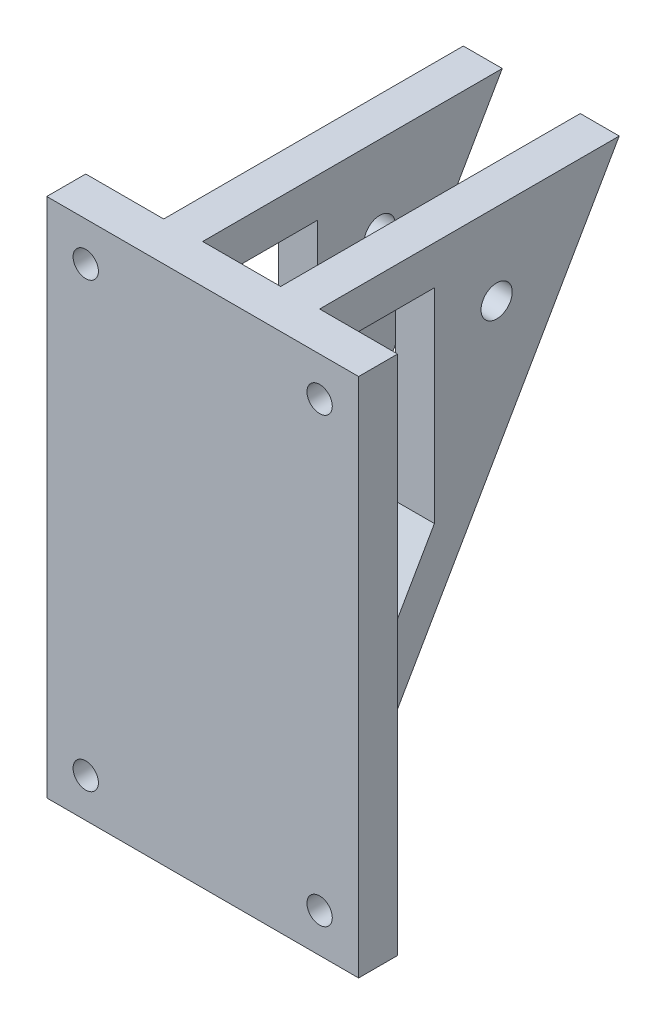
ISO-10303-21;
HEADER;
FILE_DESCRIPTION(('STEP AP214'),'2;1');
FILE_NAME('part.step','',(''),(''),'','','');
FILE_SCHEMA(('AUTOMOTIVE_DESIGN { 1 0 10303 214 1 1 1 1 }'));
ENDSEC;
DATA;
#1=APPLICATION_CONTEXT('core data for automotive mechanical design processes');
#2=APPLICATION_PROTOCOL_DEFINITION('international standard','automotive_design',2000,#1);
#3=PRODUCT_CONTEXT('',#1,'mechanical');
#4=PRODUCT('Part','Part','',(#3));
#5=PRODUCT_RELATED_PRODUCT_CATEGORY('part','',(#4));
#6=PRODUCT_DEFINITION_FORMATION('','',#4);
#7=PRODUCT_DEFINITION_CONTEXT('part definition',#1,'design');
#8=PRODUCT_DEFINITION('design','',#6,#7);
#9=PRODUCT_DEFINITION_SHAPE('','',#8);
#10=(LENGTH_UNIT() NAMED_UNIT(*) SI_UNIT(.MILLI.,.METRE.));
#11=(NAMED_UNIT(*) PLANE_ANGLE_UNIT() SI_UNIT($,.RADIAN.));
#12=(NAMED_UNIT(*) SI_UNIT($,.STERADIAN.) SOLID_ANGLE_UNIT());
#13=UNCERTAINTY_MEASURE_WITH_UNIT(LENGTH_MEASURE(1.E-05),#10,'distance_accuracy_value','');
#14=(GEOMETRIC_REPRESENTATION_CONTEXT(3) GLOBAL_UNCERTAINTY_ASSIGNED_CONTEXT((#13)) GLOBAL_UNIT_ASSIGNED_CONTEXT((#10,
#11,#12)) REPRESENTATION_CONTEXT('',''));
#15=CARTESIAN_POINT('',(0.,0.,0.));
#16=DIRECTION('',(0.,0.,1.));
#17=DIRECTION('',(1.,0.,0.));
#18=AXIS2_PLACEMENT_3D('',#15,#16,#17);
#19=CARTESIAN_POINT('',(0.,0.,0.));
#20=DIRECTION('',(0.,0.,1.));
#21=DIRECTION('',(1.,0.,0.));
#22=AXIS2_PLACEMENT_3D('',#19,#20,#21);
#23=PLANE('',#22);
#24=CARTESIAN_POINT('',(-30.,-123.630843717382,0.));
#25=DIRECTION('',(0.,0.,1.));
#26=DIRECTION('',(1.,0.,0.));
#27=AXIS2_PLACEMENT_3D('',#24,#25,#26);
#28=CIRCLE('',#27,3.25);
#29=CARTESIAN_POINT('',(-26.75,-123.630843717382,0.));
#30=VERTEX_POINT('',#29);
#31=EDGE_CURVE('E228',#30,#30,#28,.T.);
#32=ORIENTED_EDGE('',*,*,#31,.T.);
#33=EDGE_LOOP('',(#32));
#34=FACE_BOUND('',#33,.T.);
#35=CARTESIAN_POINT('',(-30.,-10.,0.));
#36=DIRECTION('',(0.,0.,1.));
#37=DIRECTION('',(1.,0.,0.));
#38=AXIS2_PLACEMENT_3D('',#35,#36,#37);
#39=CIRCLE('',#38,3.25);
#40=CARTESIAN_POINT('',(-26.75,-10.,0.));
#41=VERTEX_POINT('',#40);
#42=EDGE_CURVE('E240',#41,#41,#39,.T.);
#43=ORIENTED_EDGE('',*,*,#42,.T.);
#44=EDGE_LOOP('',(#43));
#45=FACE_BOUND('',#44,.T.);
#46=DIRECTION('',(0.,-1.,0.));
#47=VECTOR('',#46,1.);
#48=CARTESIAN_POINT('',(-20.,-133.630843717382,0.));
#49=LINE('',#48,#47);
#50=CARTESIAN_POINT('',(-20.,0.,0.));
#51=VERTEX_POINT('',#50);
#52=CARTESIAN_POINT('',(-20.,-133.630843717382,0.));
#53=VERTEX_POINT('',#52);
#54=EDGE_CURVE('E206',#51,#53,#49,.T.);
#55=ORIENTED_EDGE('',*,*,#54,.T.);
#56=DIRECTION('',(1.,0.,0.));
#57=VECTOR('',#56,1.);
#58=CARTESIAN_POINT('',(-40.,-133.630843717382,0.));
#59=LINE('',#58,#57);
#60=CARTESIAN_POINT('',(-40.,-133.630843717382,0.));
#61=VERTEX_POINT('',#60);
#62=EDGE_CURVE('E263',#61,#53,#59,.T.);
#63=ORIENTED_EDGE('',*,*,#62,.F.);
#64=DIRECTION('',(0.,-1.,0.));
#65=VECTOR('',#64,1.);
#66=CARTESIAN_POINT('',(-40.,0.,0.));
#67=LINE('',#66,#65);
#68=CARTESIAN_POINT('',(-40.,0.,0.));
#69=VERTEX_POINT('',#68);
#70=EDGE_CURVE('E246',#69,#61,#67,.T.);
#71=ORIENTED_EDGE('',*,*,#70,.F.);
#72=DIRECTION('',(-1.,0.,0.));
#73=VECTOR('',#72,1.);
#74=CARTESIAN_POINT('',(-40.,0.,0.));
#75=LINE('',#74,#73);
#76=EDGE_CURVE('E269',#51,#69,#75,.T.);
#77=ORIENTED_EDGE('',*,*,#76,.F.);
#78=EDGE_LOOP('',(#55,#63,#71,#77));
#79=FACE_BOUND('',#78,.T.);
#80=ADVANCED_FACE('F33',(#34,#45,#79),#23,.F.);
#81=CARTESIAN_POINT('',(20.,0.,0.));
#82=DIRECTION('',(-1.,0.,0.));
#83=DIRECTION('',(0.,0.,1.));
#84=AXIS2_PLACEMENT_3D('',#81,#82,#83);
#85=PLANE('',#84);
#86=DIRECTION('',(0.,-1.,0.));
#87=VECTOR('',#86,1.);
#88=CARTESIAN_POINT('',(20.,-133.630843717382,0.));
#89=LINE('',#88,#87);
#90=CARTESIAN_POINT('',(20.,0.,0.));
#91=VERTEX_POINT('',#90);
#92=CARTESIAN_POINT('',(20.,-133.630843717382,0.));
#93=VERTEX_POINT('',#92);
#94=EDGE_CURVE('E320',#91,#93,#89,.T.);
#95=ORIENTED_EDGE('',*,*,#94,.T.);
#96=DIRECTION('',(0.,0.866842420670192,-0.498582207591328));
#97=VECTOR('',#96,1.);
#98=CARTESIAN_POINT('',(20.,0.,-76.8605221366447));
#99=LINE('',#98,#97);
#100=CARTESIAN_POINT('',(20.,0.,-76.8605221366447));
#101=VERTEX_POINT('',#100);
#102=EDGE_CURVE('E323',#93,#101,#99,.T.);
#103=ORIENTED_EDGE('',*,*,#102,.T.);
#104=DIRECTION('',(0.,0.,1.));
#105=VECTOR('',#104,1.);
#106=CARTESIAN_POINT('',(20.,0.,0.));
#107=LINE('',#106,#105);
#108=EDGE_CURVE('E326',#101,#91,#107,.T.);
#109=ORIENTED_EDGE('',*,*,#108,.T.);
#110=EDGE_LOOP('',(#95,#103,#109));
#111=FACE_BOUND('',#110,.T.);
#112=DIRECTION('',(0.,0.,1.));
#113=VECTOR('',#112,1.);
#114=CARTESIAN_POINT('',(20.,-9.99999999999999,-29.4415601859224));
#115=LINE('',#114,#113);
#116=CARTESIAN_POINT('',(20.,-9.99999999999999,-29.4415601859224));
#117=VERTEX_POINT('',#116);
#118=CARTESIAN_POINT('',(20.,-10.,-10.));
#119=VERTEX_POINT('',#118);
#120=EDGE_CURVE('E291',#117,#119,#115,.T.);
#121=ORIENTED_EDGE('',*,*,#120,.F.);
#122=DIRECTION('',(0.,1.,0.));
#123=VECTOR('',#122,1.);
#124=CARTESIAN_POINT('',(20.,-62.3864375612205,-29.4415601859224));
#125=LINE('',#124,#123);
#126=CARTESIAN_POINT('',(20.,-62.3864375612205,-29.4415601859224));
#127=VERTEX_POINT('',#126);
#128=EDGE_CURVE('E298',#127,#117,#125,.T.);
#129=ORIENTED_EDGE('',*,*,#128,.F.);
#130=DIRECTION('',(0.,0.866842420670192,-0.498582207591329));
#131=VECTOR('',#130,1.);
#132=CARTESIAN_POINT('',(20.,-96.187822441332,-10.));
#133=LINE('',#132,#131);
#134=CARTESIAN_POINT('',(20.,-96.187822441332,-10.));
#135=VERTEX_POINT('',#134);
#136=EDGE_CURVE('E296',#135,#127,#133,.T.);
#137=ORIENTED_EDGE('',*,*,#136,.F.);
#138=DIRECTION('',(0.,-1.,0.));
#139=VECTOR('',#138,1.);
#140=CARTESIAN_POINT('',(20.,-10.,-10.));
#141=LINE('',#140,#139);
#142=EDGE_CURVE('E293',#119,#135,#141,.T.);
#143=ORIENTED_EDGE('',*,*,#142,.F.);
#144=EDGE_LOOP('',(#121,#129,#137,#143));
#145=FACE_BOUND('',#144,.T.);
#146=CARTESIAN_POINT('',(20.,-20.9097556107171,-45.4094021104653));
#147=DIRECTION('',(1.,0.,0.));
#148=DIRECTION('',(0.,0.,-1.));
#149=AXIS2_PLACEMENT_3D('',#146,#147,#148);
#150=CIRCLE('',#149,4.00000000000001);
#151=CARTESIAN_POINT('',(20.,-20.9097556107171,-49.4094021104653));
#152=VERTEX_POINT('',#151);
#153=EDGE_CURVE('E285',#152,#152,#150,.T.);
#154=ORIENTED_EDGE('',*,*,#153,.F.);
#155=EDGE_LOOP('',(#154));
#156=FACE_BOUND('',#155,.T.);
#157=ADVANCED_FACE('F379',(#111,#145,#156),#85,.F.);
#158=CARTESIAN_POINT('',(10.,0.,0.));
#159=DIRECTION('',(-1.,0.,0.));
#160=DIRECTION('',(0.,0.,1.));
#161=AXIS2_PLACEMENT_3D('',#158,#159,#160);
#162=PLANE('',#161);
#163=DIRECTION('',(0.,1.,0.));
#164=VECTOR('',#163,1.);
#165=CARTESIAN_POINT('',(10.,-62.3864375612205,-29.4415601859224));
#166=LINE('',#165,#164);
#167=CARTESIAN_POINT('',(10.,-62.3864375612205,-29.4415601859224));
#168=VERTEX_POINT('',#167);
#169=CARTESIAN_POINT('',(10.,-9.99999999999999,-29.4415601859224));
#170=VERTEX_POINT('',#169);
#171=EDGE_CURVE('E294',#168,#170,#166,.T.);
#172=ORIENTED_EDGE('',*,*,#171,.T.);
#173=DIRECTION('',(0.,0.,1.));
#174=VECTOR('',#173,1.);
#175=CARTESIAN_POINT('',(10.,-9.99999999999999,-29.4415601859224));
#176=LINE('',#175,#174);
#177=CARTESIAN_POINT('',(10.,-10.,-10.));
#178=VERTEX_POINT('',#177);
#179=EDGE_CURVE('E288',#170,#178,#176,.T.);
#180=ORIENTED_EDGE('',*,*,#179,.T.);
#181=DIRECTION('',(0.,-1.,0.));
#182=VECTOR('',#181,1.);
#183=CARTESIAN_POINT('',(10.,-10.,-10.));
#184=LINE('',#183,#182);
#185=CARTESIAN_POINT('',(10.,-96.187822441332,-10.));
#186=VERTEX_POINT('',#185);
#187=EDGE_CURVE('E303',#178,#186,#184,.T.);
#188=ORIENTED_EDGE('',*,*,#187,.T.);
#189=DIRECTION('',(0.,0.866842420670192,-0.498582207591329));
#190=VECTOR('',#189,1.);
#191=CARTESIAN_POINT('',(10.,-96.187822441332,-10.));
#192=LINE('',#191,#190);
#193=EDGE_CURVE('E306',#186,#168,#192,.T.);
#194=ORIENTED_EDGE('',*,*,#193,.T.);
#195=EDGE_LOOP('',(#172,#180,#188,#194));
#196=FACE_BOUND('',#195,.T.);
#197=DIRECTION('',(0.,-1.,0.));
#198=VECTOR('',#197,1.);
#199=CARTESIAN_POINT('',(10.,-133.630843717382,0.));
#200=LINE('',#199,#198);
#201=CARTESIAN_POINT('',(10.,0.,0.));
#202=VERTEX_POINT('',#201);
#203=CARTESIAN_POINT('',(10.,-133.630843717382,0.));
#204=VERTEX_POINT('',#203);
#205=EDGE_CURVE('E319',#202,#204,#200,.T.);
#206=ORIENTED_EDGE('',*,*,#205,.F.);
#207=DIRECTION('',(0.,0.,1.));
#208=VECTOR('',#207,1.);
#209=CARTESIAN_POINT('',(10.,0.,0.));
#210=LINE('',#209,#208);
#211=CARTESIAN_POINT('',(10.,0.,-76.8605221366447));
#212=VERTEX_POINT('',#211);
#213=EDGE_CURVE('E324',#212,#202,#210,.T.);
#214=ORIENTED_EDGE('',*,*,#213,.F.);
#215=DIRECTION('',(0.,0.866842420670192,-0.498582207591328));
#216=VECTOR('',#215,1.);
#217=CARTESIAN_POINT('',(10.,0.,-76.8605221366447));
#218=LINE('',#217,#216);
#219=EDGE_CURVE('E331',#204,#212,#218,.T.);
#220=ORIENTED_EDGE('',*,*,#219,.F.);
#221=EDGE_LOOP('',(#206,#214,#220));
#222=FACE_BOUND('',#221,.T.);
#223=CARTESIAN_POINT('',(10.,-20.9097556107171,-45.4094021104653));
#224=DIRECTION('',(1.,0.,0.));
#225=DIRECTION('',(0.,0.,-1.));
#226=AXIS2_PLACEMENT_3D('',#223,#224,#225);
#227=CIRCLE('',#226,4.00000000000001);
#228=CARTESIAN_POINT('',(10.,-20.9097556107171,-49.4094021104653));
#229=VERTEX_POINT('',#228);
#230=EDGE_CURVE('E284',#229,#229,#227,.T.);
#231=ORIENTED_EDGE('',*,*,#230,.T.);
#232=EDGE_LOOP('',(#231));
#233=FACE_BOUND('',#232,.T.);
#234=ADVANCED_FACE('F346',(#196,#222,#233),#162,.T.);
#235=CARTESIAN_POINT('',(20.,0.,-76.8605221366447));
#236=DIRECTION('',(0.,0.498582207591328,0.866842420670192));
#237=DIRECTION('',(0.,-0.866842420670192,0.498582207591328));
#238=AXIS2_PLACEMENT_3D('',#235,#236,#237);
#239=PLANE('',#238);
#240=ORIENTED_EDGE('',*,*,#219,.T.);
#241=DIRECTION('',(-1.,0.,0.));
#242=VECTOR('',#241,1.);
#243=CARTESIAN_POINT('',(20.,0.,-76.8605221366447));
#244=LINE('',#243,#242);
#245=EDGE_CURVE('E41',#101,#212,#244,.T.);
#246=ORIENTED_EDGE('',*,*,#245,.F.);
#247=ORIENTED_EDGE('',*,*,#102,.F.);
#248=DIRECTION('',(-1.,0.,0.));
#249=VECTOR('',#248,1.);
#250=CARTESIAN_POINT('',(20.,-133.630843717382,0.));
#251=LINE('',#250,#249);
#252=EDGE_CURVE('E11',#93,#204,#251,.T.);
#253=ORIENTED_EDGE('',*,*,#252,.T.);
#254=EDGE_LOOP('',(#240,#246,#247,#253));
#255=FACE_BOUND('',#254,.T.);
#256=ADVANCED_FACE('F35',(#255),#239,.F.);
#257=CARTESIAN_POINT('',(20.,0.,0.));
#258=DIRECTION('',(0.,-1.,0.));
#259=DIRECTION('',(0.,0.,-1.));
#260=AXIS2_PLACEMENT_3D('',#257,#258,#259);
#261=PLANE('',#260);
#262=ORIENTED_EDGE('',*,*,#213,.T.);
#263=CARTESIAN_POINT('',(-10.,0.,0.));
#264=VERTEX_POINT('',#263);
#265=EDGE_CURVE('E272',#202,#264,#75,.T.);
#266=ORIENTED_EDGE('',*,*,#265,.T.);
#267=DIRECTION('',(0.,0.,1.));
#268=VECTOR('',#267,1.);
#269=CARTESIAN_POINT('',(-10.,0.,0.));
#270=LINE('',#269,#268);
#271=CARTESIAN_POINT('',(-10.,0.,-76.8605221366447));
#272=VERTEX_POINT('',#271);
#273=EDGE_CURVE('E210',#272,#264,#270,.T.);
#274=ORIENTED_EDGE('',*,*,#273,.F.);
#275=DIRECTION('',(1.,0.,0.));
#276=VECTOR('',#275,1.);
#277=CARTESIAN_POINT('',(-20.,0.,-76.8605221366447));
#278=LINE('',#277,#276);
#279=CARTESIAN_POINT('',(-20.,0.,-76.8605221366447));
#280=VERTEX_POINT('',#279);
#281=EDGE_CURVE('E215',#280,#272,#278,.T.);
#282=ORIENTED_EDGE('',*,*,#281,.F.);
#283=DIRECTION('',(0.,0.,1.));
#284=VECTOR('',#283,1.);
#285=CARTESIAN_POINT('',(-20.,0.,0.));
#286=LINE('',#285,#284);
#287=EDGE_CURVE('E213',#280,#51,#286,.T.);
#288=ORIENTED_EDGE('',*,*,#287,.T.);
#289=ORIENTED_EDGE('',*,*,#76,.T.);
#290=DIRECTION('',(0.,0.,-1.));
#291=VECTOR('',#290,1.);
#292=CARTESIAN_POINT('',(-40.,0.,10.));
#293=LINE('',#292,#291);
#294=CARTESIAN_POINT('',(-40.,0.,10.));
#295=VERTEX_POINT('',#294);
#296=EDGE_CURVE('E259',#295,#69,#293,.T.);
#297=ORIENTED_EDGE('',*,*,#296,.F.);
#298=DIRECTION('',(-1.,0.,0.));
#299=VECTOR('',#298,1.);
#300=CARTESIAN_POINT('',(-40.,0.,10.));
#301=LINE('',#300,#299);
#302=CARTESIAN_POINT('',(40.,0.,10.));
#303=VERTEX_POINT('',#302);
#304=EDGE_CURVE('E257',#303,#295,#301,.T.);
#305=ORIENTED_EDGE('',*,*,#304,.F.);
#306=DIRECTION('',(0.,0.,-1.));
#307=VECTOR('',#306,1.);
#308=CARTESIAN_POINT('',(40.,0.,10.));
#309=LINE('',#308,#307);
#310=CARTESIAN_POINT('',(40.,0.,0.));
#311=VERTEX_POINT('',#310);
#312=EDGE_CURVE('E275',#303,#311,#309,.T.);
#313=ORIENTED_EDGE('',*,*,#312,.T.);
#314=EDGE_CURVE('E253',#311,#91,#75,.T.);
#315=ORIENTED_EDGE('',*,*,#314,.T.);
#316=ORIENTED_EDGE('',*,*,#108,.F.);
#317=ORIENTED_EDGE('',*,*,#245,.T.);
#318=EDGE_LOOP('',(#262,#266,#274,#282,#288,#289,#297,#305,#313,#315,#316,#317));
#319=FACE_BOUND('',#318,.T.);
#320=ADVANCED_FACE('F339',(#319),#261,.F.);
#321=CARTESIAN_POINT('',(20.,-9.99999999999999,-29.4415601859224));
#322=DIRECTION('',(0.,-1.,0.));
#323=DIRECTION('',(0.,0.,-1.));
#324=AXIS2_PLACEMENT_3D('',#321,#322,#323);
#325=PLANE('',#324);
#326=ORIENTED_EDGE('',*,*,#179,.F.);
#327=DIRECTION('',(-1.,0.,0.));
#328=VECTOR('',#327,1.);
#329=CARTESIAN_POINT('',(20.,-9.99999999999999,-29.4415601859224));
#330=LINE('',#329,#328);
#331=EDGE_CURVE('E300',#117,#170,#330,.T.);
#332=ORIENTED_EDGE('',*,*,#331,.F.);
#333=ORIENTED_EDGE('',*,*,#120,.T.);
#334=DIRECTION('',(-1.,0.,0.));
#335=VECTOR('',#334,1.);
#336=CARTESIAN_POINT('',(20.,-10.,-10.));
#337=LINE('',#336,#335);
#338=EDGE_CURVE('E316',#119,#178,#337,.T.);
#339=ORIENTED_EDGE('',*,*,#338,.T.);
#340=EDGE_LOOP('',(#326,#332,#333,#339));
#341=FACE_BOUND('',#340,.T.);
#342=ADVANCED_FACE('F563',(#341),#325,.T.);
#343=CARTESIAN_POINT('',(20.,-10.,-10.));
#344=DIRECTION('',(0.,0.,-1.));
#345=DIRECTION('',(-1.,0.,0.));
#346=AXIS2_PLACEMENT_3D('',#343,#344,#345);
#347=PLANE('',#346);
#348=ORIENTED_EDGE('',*,*,#187,.F.);
#349=ORIENTED_EDGE('',*,*,#338,.F.);
#350=ORIENTED_EDGE('',*,*,#142,.T.);
#351=DIRECTION('',(-1.,0.,0.));
#352=VECTOR('',#351,1.);
#353=CARTESIAN_POINT('',(20.,-96.187822441332,-10.));
#354=LINE('',#353,#352);
#355=EDGE_CURVE('E314',#135,#186,#354,.T.);
#356=ORIENTED_EDGE('',*,*,#355,.T.);
#357=EDGE_LOOP('',(#348,#349,#350,#356));
#358=FACE_BOUND('',#357,.T.);
#359=ADVANCED_FACE('F617',(#358),#347,.T.);
#360=CARTESIAN_POINT('',(20.,-96.187822441332,-10.));
#361=DIRECTION('',(0.,0.498582207591329,0.866842420670192));
#362=DIRECTION('',(0.,-0.866842420670192,0.498582207591329));
#363=AXIS2_PLACEMENT_3D('',#360,#361,#362);
#364=PLANE('',#363);
#365=ORIENTED_EDGE('',*,*,#193,.F.);
#366=ORIENTED_EDGE('',*,*,#355,.F.);
#367=ORIENTED_EDGE('',*,*,#136,.T.);
#368=DIRECTION('',(-1.,0.,0.));
#369=VECTOR('',#368,1.);
#370=CARTESIAN_POINT('',(20.,-62.3864375612205,-29.4415601859224));
#371=LINE('',#370,#369);
#372=EDGE_CURVE('E56',#127,#168,#371,.T.);
#373=ORIENTED_EDGE('',*,*,#372,.T.);
#374=EDGE_LOOP('',(#365,#366,#367,#373));
#375=FACE_BOUND('',#374,.T.);
#376=ADVANCED_FACE('F608',(#375),#364,.T.);
#377=CARTESIAN_POINT('',(20.,-62.3864375612205,-29.4415601859224));
#378=DIRECTION('',(0.,0.,1.));
#379=DIRECTION('',(1.,0.,0.));
#380=AXIS2_PLACEMENT_3D('',#377,#378,#379);
#381=PLANE('',#380);
#382=ORIENTED_EDGE('',*,*,#171,.F.);
#383=ORIENTED_EDGE('',*,*,#372,.F.);
#384=ORIENTED_EDGE('',*,*,#128,.T.);
#385=ORIENTED_EDGE('',*,*,#331,.T.);
#386=EDGE_LOOP('',(#382,#383,#384,#385));
#387=FACE_BOUND('',#386,.T.);
#388=ADVANCED_FACE('F598',(#387),#381,.T.);
#389=CARTESIAN_POINT('',(20.,-20.9097556107171,-45.4094021104653));
#390=DIRECTION('',(-1.,0.,0.));
#391=DIRECTION('',(0.,0.,1.));
#392=AXIS2_PLACEMENT_3D('',#389,#390,#391);
#393=CYLINDRICAL_SURFACE('',#392,4.00000000000001);
#394=ORIENTED_EDGE('',*,*,#153,.T.);
#395=EDGE_LOOP('',(#394));
#396=FACE_BOUND('',#395,.T.);
#397=ORIENTED_EDGE('',*,*,#230,.F.);
#398=EDGE_LOOP('',(#397));
#399=FACE_BOUND('',#398,.T.);
#400=ADVANCED_FACE('F410',(#396,#399),#393,.F.);
#401=CARTESIAN_POINT('',(-10.,-133.630843717382,0.));
#402=VERTEX_POINT('',#401);
#403=EDGE_CURVE('E267',#402,#204,#59,.T.);
#404=ORIENTED_EDGE('',*,*,#403,.F.);
#405=DIRECTION('',(0.,-1.,0.));
#406=VECTOR('',#405,1.);
#407=CARTESIAN_POINT('',(-10.,-133.630843717382,0.));
#408=LINE('',#407,#406);
#409=EDGE_CURVE('E48',#264,#402,#408,.T.);
#410=ORIENTED_EDGE('',*,*,#409,.F.);
#411=ORIENTED_EDGE('',*,*,#265,.F.);
#412=ORIENTED_EDGE('',*,*,#205,.T.);
#413=EDGE_LOOP('',(#404,#410,#411,#412));
#414=FACE_BOUND('',#413,.T.);
#415=ADVANCED_FACE('F350',(#414),#23,.F.);
#416=CARTESIAN_POINT('',(0.,0.,10.));
#417=DIRECTION('',(0.,0.,1.));
#418=DIRECTION('',(1.,0.,0.));
#419=AXIS2_PLACEMENT_3D('',#416,#417,#418);
#420=PLANE('',#419);
#421=CARTESIAN_POINT('',(-30.,-123.630843717382,10.));
#422=DIRECTION('',(0.,0.,1.));
#423=DIRECTION('',(1.,0.,0.));
#424=AXIS2_PLACEMENT_3D('',#421,#422,#423);
#425=CIRCLE('',#424,3.25);
#426=CARTESIAN_POINT('',(-26.75,-123.630843717382,10.));
#427=VERTEX_POINT('',#426);
#428=EDGE_CURVE('E231',#427,#427,#425,.T.);
#429=ORIENTED_EDGE('',*,*,#428,.F.);
#430=EDGE_LOOP('',(#429));
#431=FACE_BOUND('',#430,.T.);
#432=CARTESIAN_POINT('',(-30.,-10.,10.));
#433=DIRECTION('',(0.,0.,1.));
#434=DIRECTION('',(1.,0.,0.));
#435=AXIS2_PLACEMENT_3D('',#432,#433,#434);
#436=CIRCLE('',#435,3.25);
#437=CARTESIAN_POINT('',(-26.75,-10.,10.));
#438=VERTEX_POINT('',#437);
#439=EDGE_CURVE('E243',#438,#438,#436,.T.);
#440=ORIENTED_EDGE('',*,*,#439,.F.);
#441=EDGE_LOOP('',(#440));
#442=FACE_BOUND('',#441,.T.);
#443=DIRECTION('',(0.,-1.,0.));
#444=VECTOR('',#443,1.);
#445=CARTESIAN_POINT('',(-40.,0.,10.));
#446=LINE('',#445,#444);
#447=CARTESIAN_POINT('',(-40.,-133.630843717382,10.));
#448=VERTEX_POINT('',#447);
#449=EDGE_CURVE('E249',#295,#448,#446,.T.);
#450=ORIENTED_EDGE('',*,*,#449,.T.);
#451=DIRECTION('',(1.,0.,0.));
#452=VECTOR('',#451,1.);
#453=CARTESIAN_POINT('',(-40.,-133.630843717382,10.));
#454=LINE('',#453,#452);
#455=CARTESIAN_POINT('',(40.,-133.630843717382,10.));
#456=VERTEX_POINT('',#455);
#457=EDGE_CURVE('E252',#448,#456,#454,.T.);
#458=ORIENTED_EDGE('',*,*,#457,.T.);
#459=DIRECTION('',(0.,1.,0.));
#460=VECTOR('',#459,1.);
#461=CARTESIAN_POINT('',(40.,0.,10.));
#462=LINE('',#461,#460);
#463=EDGE_CURVE('E255',#456,#303,#462,.T.);
#464=ORIENTED_EDGE('',*,*,#463,.T.);
#465=ORIENTED_EDGE('',*,*,#304,.T.);
#466=EDGE_LOOP('',(#450,#458,#464,#465));
#467=FACE_BOUND('',#466,.T.);
#468=CARTESIAN_POINT('',(30.,-10.,10.));
#469=DIRECTION('',(0.,0.,1.));
#470=DIRECTION('',(1.,0.,0.));
#471=AXIS2_PLACEMENT_3D('',#468,#469,#470);
#472=CIRCLE('',#471,3.25);
#473=CARTESIAN_POINT('',(33.25,-10.,10.));
#474=VERTEX_POINT('',#473);
#475=EDGE_CURVE('E237',#474,#474,#472,.T.);
#476=ORIENTED_EDGE('',*,*,#475,.F.);
#477=EDGE_LOOP('',(#476));
#478=FACE_BOUND('',#477,.T.);
#479=CARTESIAN_POINT('',(30.,-123.630843717382,10.));
#480=DIRECTION('',(0.,0.,1.));
#481=DIRECTION('',(1.,0.,0.));
#482=AXIS2_PLACEMENT_3D('',#479,#480,#481);
#483=CIRCLE('',#482,3.24999999999999);
#484=CARTESIAN_POINT('',(33.25,-123.630843717382,10.));
#485=VERTEX_POINT('',#484);
#486=EDGE_CURVE('E225',#485,#485,#483,.T.);
#487=ORIENTED_EDGE('',*,*,#486,.F.);
#488=EDGE_LOOP('',(#487));
#489=FACE_BOUND('',#488,.T.);
#490=ADVANCED_FACE('F368',(#431,#442,#467,#478,#489),#420,.T.);
#491=ORIENTED_EDGE('',*,*,#94,.F.);
#492=ORIENTED_EDGE('',*,*,#314,.F.);
#493=DIRECTION('',(0.,1.,0.));
#494=VECTOR('',#493,1.);
#495=CARTESIAN_POINT('',(40.,0.,0.));
#496=LINE('',#495,#494);
#497=CARTESIAN_POINT('',(40.,-133.630843717382,0.));
#498=VERTEX_POINT('',#497);
#499=EDGE_CURVE('E266',#498,#311,#496,.T.);
#500=ORIENTED_EDGE('',*,*,#499,.F.);
#501=EDGE_CURVE('E262',#93,#498,#59,.T.);
#502=ORIENTED_EDGE('',*,*,#501,.F.);
#503=EDGE_LOOP('',(#491,#492,#500,#502));
#504=FACE_BOUND('',#503,.T.);
#505=CARTESIAN_POINT('',(30.,-10.,0.));
#506=DIRECTION('',(0.,0.,1.));
#507=DIRECTION('',(1.,0.,0.));
#508=AXIS2_PLACEMENT_3D('',#505,#506,#507);
#509=CIRCLE('',#508,3.25);
#510=CARTESIAN_POINT('',(33.25,-10.,0.));
#511=VERTEX_POINT('',#510);
#512=EDGE_CURVE('E234',#511,#511,#509,.T.);
#513=ORIENTED_EDGE('',*,*,#512,.T.);
#514=EDGE_LOOP('',(#513));
#515=FACE_BOUND('',#514,.T.);
#516=CARTESIAN_POINT('',(30.,-123.630843717382,0.));
#517=DIRECTION('',(0.,0.,1.));
#518=DIRECTION('',(1.,0.,0.));
#519=AXIS2_PLACEMENT_3D('',#516,#517,#518);
#520=CIRCLE('',#519,3.24999999999999);
#521=CARTESIAN_POINT('',(33.25,-123.630843717382,0.));
#522=VERTEX_POINT('',#521);
#523=EDGE_CURVE('E224',#522,#522,#520,.T.);
#524=ORIENTED_EDGE('',*,*,#523,.T.);
#525=EDGE_LOOP('',(#524));
#526=FACE_BOUND('',#525,.T.);
#527=ADVANCED_FACE('F375',(#504,#515,#526),#23,.F.);
#528=CARTESIAN_POINT('',(-40.,0.,10.));
#529=DIRECTION('',(1.,0.,0.));
#530=DIRECTION('',(0.,1.,0.));
#531=AXIS2_PLACEMENT_3D('',#528,#529,#530);
#532=PLANE('',#531);
#533=ORIENTED_EDGE('',*,*,#70,.T.);
#534=DIRECTION('',(0.,0.,-1.));
#535=VECTOR('',#534,1.);
#536=CARTESIAN_POINT('',(-40.,-133.630843717382,10.));
#537=LINE('',#536,#535);
#538=EDGE_CURVE('E281',#448,#61,#537,.T.);
#539=ORIENTED_EDGE('',*,*,#538,.F.);
#540=ORIENTED_EDGE('',*,*,#449,.F.);
#541=ORIENTED_EDGE('',*,*,#296,.T.);
#542=EDGE_LOOP('',(#533,#539,#540,#541));
#543=FACE_BOUND('',#542,.T.);
#544=ADVANCED_FACE('F361',(#543),#532,.F.);
#545=CARTESIAN_POINT('',(-40.,-133.630843717382,10.));
#546=DIRECTION('',(0.,1.,0.));
#547=DIRECTION('',(0.,0.,1.));
#548=AXIS2_PLACEMENT_3D('',#545,#546,#547);
#549=PLANE('',#548);
#550=ORIENTED_EDGE('',*,*,#62,.T.);
#551=DIRECTION('',(1.,0.,0.));
#552=VECTOR('',#551,1.);
#553=CARTESIAN_POINT('',(-20.,-133.630843717382,0.));
#554=LINE('',#553,#552);
#555=EDGE_CURVE('E221',#53,#402,#554,.T.);
#556=ORIENTED_EDGE('',*,*,#555,.T.);
#557=ORIENTED_EDGE('',*,*,#403,.T.);
#558=ORIENTED_EDGE('',*,*,#252,.F.);
#559=ORIENTED_EDGE('',*,*,#501,.T.);
#560=DIRECTION('',(0.,0.,-1.));
#561=VECTOR('',#560,1.);
#562=CARTESIAN_POINT('',(40.,-133.630843717382,10.));
#563=LINE('',#562,#561);
#564=EDGE_CURVE('E278',#456,#498,#563,.T.);
#565=ORIENTED_EDGE('',*,*,#564,.F.);
#566=ORIENTED_EDGE('',*,*,#457,.F.);
#567=ORIENTED_EDGE('',*,*,#538,.T.);
#568=EDGE_LOOP('',(#550,#556,#557,#558,#559,#565,#566,#567));
#569=FACE_BOUND('',#568,.T.);
#570=ADVANCED_FACE('F364',(#569),#549,.F.);
#571=CARTESIAN_POINT('',(40.,0.,10.));
#572=DIRECTION('',(-1.,0.,0.));
#573=DIRECTION('',(0.,-1.,0.));
#574=AXIS2_PLACEMENT_3D('',#571,#572,#573);
#575=PLANE('',#574);
#576=ORIENTED_EDGE('',*,*,#499,.T.);
#577=ORIENTED_EDGE('',*,*,#312,.F.);
#578=ORIENTED_EDGE('',*,*,#463,.F.);
#579=ORIENTED_EDGE('',*,*,#564,.T.);
#580=EDGE_LOOP('',(#576,#577,#578,#579));
#581=FACE_BOUND('',#580,.T.);
#582=ADVANCED_FACE('F427',(#581),#575,.F.);
#583=CARTESIAN_POINT('',(-30.,-10.,10.));
#584=DIRECTION('',(0.,0.,-1.));
#585=DIRECTION('',(-1.,0.,0.));
#586=AXIS2_PLACEMENT_3D('',#583,#584,#585);
#587=CYLINDRICAL_SURFACE('',#586,3.25);
#588=ORIENTED_EDGE('',*,*,#439,.T.);
#589=EDGE_LOOP('',(#588));
#590=FACE_BOUND('',#589,.T.);
#591=ORIENTED_EDGE('',*,*,#42,.F.);
#592=EDGE_LOOP('',(#591));
#593=FACE_BOUND('',#592,.T.);
#594=ADVANCED_FACE('F423',(#590,#593),#587,.F.);
#595=CARTESIAN_POINT('',(30.,-10.,10.));
#596=DIRECTION('',(0.,0.,-1.));
#597=DIRECTION('',(-1.,0.,0.));
#598=AXIS2_PLACEMENT_3D('',#595,#596,#597);
#599=CYLINDRICAL_SURFACE('',#598,3.25);
#600=ORIENTED_EDGE('',*,*,#475,.T.);
#601=EDGE_LOOP('',(#600));
#602=FACE_BOUND('',#601,.T.);
#603=ORIENTED_EDGE('',*,*,#512,.F.);
#604=EDGE_LOOP('',(#603));
#605=FACE_BOUND('',#604,.T.);
#606=ADVANCED_FACE('F426',(#602,#605),#599,.F.);
#607=CARTESIAN_POINT('',(-30.,-123.630843717382,10.));
#608=DIRECTION('',(0.,0.,-1.));
#609=DIRECTION('',(-1.,0.,0.));
#610=AXIS2_PLACEMENT_3D('',#607,#608,#609);
#611=CYLINDRICAL_SURFACE('',#610,3.25);
#612=ORIENTED_EDGE('',*,*,#428,.T.);
#613=EDGE_LOOP('',(#612));
#614=FACE_BOUND('',#613,.T.);
#615=ORIENTED_EDGE('',*,*,#31,.F.);
#616=EDGE_LOOP('',(#615));
#617=FACE_BOUND('',#616,.T.);
#618=ADVANCED_FACE('F395',(#614,#617),#611,.F.);
#619=CARTESIAN_POINT('',(30.,-123.630843717382,10.));
#620=DIRECTION('',(0.,0.,-1.));
#621=DIRECTION('',(-1.,0.,0.));
#622=AXIS2_PLACEMENT_3D('',#619,#620,#621);
#623=CYLINDRICAL_SURFACE('',#622,3.24999999999999);
#624=ORIENTED_EDGE('',*,*,#486,.T.);
#625=EDGE_LOOP('',(#624));
#626=FACE_BOUND('',#625,.T.);
#627=ORIENTED_EDGE('',*,*,#523,.F.);
#628=EDGE_LOOP('',(#627));
#629=FACE_BOUND('',#628,.T.);
#630=ADVANCED_FACE('F387',(#626,#629),#623,.F.);
#631=CARTESIAN_POINT('',(-20.,0.,0.));
#632=DIRECTION('',(1.,0.,0.));
#633=DIRECTION('',(0.,0.,1.));
#634=AXIS2_PLACEMENT_3D('',#631,#632,#633);
#635=PLANE('',#634);
#636=ORIENTED_EDGE('',*,*,#54,.F.);
#637=ORIENTED_EDGE('',*,*,#287,.F.);
#638=DIRECTION('',(0.,0.866842420670192,-0.498582207591328));
#639=VECTOR('',#638,1.);
#640=CARTESIAN_POINT('',(-20.,0.,-76.8605221366447));
#641=LINE('',#640,#639);
#642=EDGE_CURVE('E209',#53,#280,#641,.T.);
#643=ORIENTED_EDGE('',*,*,#642,.F.);
#644=EDGE_LOOP('',(#636,#637,#643));
#645=FACE_BOUND('',#644,.T.);
#646=DIRECTION('',(0.,0.,1.));
#647=VECTOR('',#646,1.);
#648=CARTESIAN_POINT('',(-20.,-9.99999999999999,-29.4415601859224));
#649=LINE('',#648,#647);
#650=CARTESIAN_POINT('',(-20.,-9.99999999999999,-29.4415601859224));
#651=VERTEX_POINT('',#650);
#652=CARTESIAN_POINT('',(-20.,-10.,-10.));
#653=VERTEX_POINT('',#652);
#654=EDGE_CURVE('E163',#651,#653,#649,.T.);
#655=ORIENTED_EDGE('',*,*,#654,.T.);
#656=DIRECTION('',(0.,-1.,0.));
#657=VECTOR('',#656,1.);
#658=CARTESIAN_POINT('',(-20.,-10.,-10.));
#659=LINE('',#658,#657);
#660=CARTESIAN_POINT('',(-20.,-96.187822441332,-10.));
#661=VERTEX_POINT('',#660);
#662=EDGE_CURVE('E172',#653,#661,#659,.T.);
#663=ORIENTED_EDGE('',*,*,#662,.T.);
#664=DIRECTION('',(0.,0.866842420670192,-0.498582207591329));
#665=VECTOR('',#664,1.);
#666=CARTESIAN_POINT('',(-20.,-96.187822441332,-10.));
#667=LINE('',#666,#665);
#668=CARTESIAN_POINT('',(-20.,-62.3864375612205,-29.4415601859224));
#669=VERTEX_POINT('',#668);
#670=EDGE_CURVE('E177',#661,#669,#667,.T.);
#671=ORIENTED_EDGE('',*,*,#670,.T.);
#672=DIRECTION('',(0.,1.,0.));
#673=VECTOR('',#672,1.);
#674=CARTESIAN_POINT('',(-20.,-62.3864375612205,-29.4415601859224));
#675=LINE('',#674,#673);
#676=EDGE_CURVE('E183',#669,#651,#675,.T.);
#677=ORIENTED_EDGE('',*,*,#676,.T.);
#678=EDGE_LOOP('',(#655,#663,#671,#677));
#679=FACE_BOUND('',#678,.T.);
#680=CARTESIAN_POINT('',(-20.,-20.9097556107171,-45.4094021104653));
#681=DIRECTION('',(1.,0.,0.));
#682=DIRECTION('',(0.,0.,-1.));
#683=AXIS2_PLACEMENT_3D('',#680,#681,#682);
#684=CIRCLE('',#683,4.00000000000001);
#685=CARTESIAN_POINT('',(-20.,-20.9097556107171,-49.4094021104653));
#686=VERTEX_POINT('',#685);
#687=EDGE_CURVE('E198',#686,#686,#684,.T.);
#688=ORIENTED_EDGE('',*,*,#687,.T.);
#689=EDGE_LOOP('',(#688));
#690=FACE_BOUND('',#689,.T.);
#691=ADVANCED_FACE('F180',(#645,#679,#690),#635,.F.);
#692=CARTESIAN_POINT('',(-10.,0.,0.));
#693=DIRECTION('',(1.,0.,0.));
#694=DIRECTION('',(0.,0.,1.));
#695=AXIS2_PLACEMENT_3D('',#692,#693,#694);
#696=PLANE('',#695);
#697=DIRECTION('',(0.,1.,0.));
#698=VECTOR('',#697,1.);
#699=CARTESIAN_POINT('',(-10.,-62.3864375612205,-29.4415601859224));
#700=LINE('',#699,#698);
#701=CARTESIAN_POINT('',(-10.,-62.3864375612205,-29.4415601859224));
#702=VERTEX_POINT('',#701);
#703=CARTESIAN_POINT('',(-10.,-9.99999999999999,-29.4415601859224));
#704=VERTEX_POINT('',#703);
#705=EDGE_CURVE('E184',#702,#704,#700,.T.);
#706=ORIENTED_EDGE('',*,*,#705,.F.);
#707=DIRECTION('',(0.,0.866842420670192,-0.498582207591329));
#708=VECTOR('',#707,1.);
#709=CARTESIAN_POINT('',(-10.,-96.187822441332,-10.));
#710=LINE('',#709,#708);
#711=CARTESIAN_POINT('',(-10.,-96.187822441332,-10.));
#712=VERTEX_POINT('',#711);
#713=EDGE_CURVE('E187',#712,#702,#710,.T.);
#714=ORIENTED_EDGE('',*,*,#713,.F.);
#715=DIRECTION('',(0.,-1.,0.));
#716=VECTOR('',#715,1.);
#717=CARTESIAN_POINT('',(-10.,-10.,-10.));
#718=LINE('',#717,#716);
#719=CARTESIAN_POINT('',(-10.,-10.,-10.));
#720=VERTEX_POINT('',#719);
#721=EDGE_CURVE('E197',#720,#712,#718,.T.);
#722=ORIENTED_EDGE('',*,*,#721,.F.);
#723=DIRECTION('',(0.,0.,1.));
#724=VECTOR('',#723,1.);
#725=CARTESIAN_POINT('',(-10.,-9.99999999999999,-29.4415601859224));
#726=LINE('',#725,#724);
#727=EDGE_CURVE('E165',#704,#720,#726,.T.);
#728=ORIENTED_EDGE('',*,*,#727,.F.);
#729=EDGE_LOOP('',(#706,#714,#722,#728));
#730=FACE_BOUND('',#729,.T.);
#731=ORIENTED_EDGE('',*,*,#409,.T.);
#732=DIRECTION('',(0.,0.866842420670192,-0.498582207591328));
#733=VECTOR('',#732,1.);
#734=CARTESIAN_POINT('',(-10.,0.,-76.8605221366447));
#735=LINE('',#734,#733);
#736=EDGE_CURVE('E217',#402,#272,#735,.T.);
#737=ORIENTED_EDGE('',*,*,#736,.T.);
#738=ORIENTED_EDGE('',*,*,#273,.T.);
#739=EDGE_LOOP('',(#731,#737,#738));
#740=FACE_BOUND('',#739,.T.);
#741=CARTESIAN_POINT('',(-10.,-20.9097556107171,-45.4094021104653));
#742=DIRECTION('',(1.,0.,0.));
#743=DIRECTION('',(0.,0.,-1.));
#744=AXIS2_PLACEMENT_3D('',#741,#742,#743);
#745=CIRCLE('',#744,4.00000000000001);
#746=CARTESIAN_POINT('',(-10.,-20.9097556107171,-49.4094021104653));
#747=VERTEX_POINT('',#746);
#748=EDGE_CURVE('E190',#747,#747,#745,.T.);
#749=ORIENTED_EDGE('',*,*,#748,.F.);
#750=EDGE_LOOP('',(#749));
#751=FACE_BOUND('',#750,.T.);
#752=ADVANCED_FACE('F386',(#730,#740,#751),#696,.T.);
#753=CARTESIAN_POINT('',(-20.,0.,-76.8605221366447));
#754=DIRECTION('',(0.,0.498582207591328,0.866842420670192));
#755=DIRECTION('',(0.,-0.866842420670192,0.498582207591328));
#756=AXIS2_PLACEMENT_3D('',#753,#754,#755);
#757=PLANE('',#756);
#758=ORIENTED_EDGE('',*,*,#736,.F.);
#759=ORIENTED_EDGE('',*,*,#555,.F.);
#760=ORIENTED_EDGE('',*,*,#642,.T.);
#761=ORIENTED_EDGE('',*,*,#281,.T.);
#762=EDGE_LOOP('',(#758,#759,#760,#761));
#763=FACE_BOUND('',#762,.T.);
#764=ADVANCED_FACE('F383',(#763),#757,.F.);
#765=CARTESIAN_POINT('',(-20.,-9.99999999999999,-29.4415601859224));
#766=DIRECTION('',(0.,-1.,0.));
#767=DIRECTION('',(0.,0.,-1.));
#768=AXIS2_PLACEMENT_3D('',#765,#766,#767);
#769=PLANE('',#768);
#770=ORIENTED_EDGE('',*,*,#727,.T.);
#771=DIRECTION('',(1.,0.,0.));
#772=VECTOR('',#771,1.);
#773=CARTESIAN_POINT('',(-20.,-10.,-10.));
#774=LINE('',#773,#772);
#775=EDGE_CURVE('E159',#653,#720,#774,.T.);
#776=ORIENTED_EDGE('',*,*,#775,.F.);
#777=ORIENTED_EDGE('',*,*,#654,.F.);
#778=DIRECTION('',(1.,0.,0.));
#779=VECTOR('',#778,1.);
#780=CARTESIAN_POINT('',(-20.,-9.99999999999999,-29.4415601859224));
#781=LINE('',#780,#779);
#782=EDGE_CURVE('E195',#651,#704,#781,.T.);
#783=ORIENTED_EDGE('',*,*,#782,.T.);
#784=EDGE_LOOP('',(#770,#776,#777,#783));
#785=FACE_BOUND('',#784,.T.);
#786=ADVANCED_FACE('F161',(#785),#769,.T.);
#787=CARTESIAN_POINT('',(-20.,-10.,-10.));
#788=DIRECTION('',(0.,0.,-1.));
#789=DIRECTION('',(1.,0.,0.));
#790=AXIS2_PLACEMENT_3D('',#787,#788,#789);
#791=PLANE('',#790);
#792=ORIENTED_EDGE('',*,*,#721,.T.);
#793=DIRECTION('',(1.,0.,0.));
#794=VECTOR('',#793,1.);
#795=CARTESIAN_POINT('',(-20.,-96.187822441332,-10.));
#796=LINE('',#795,#794);
#797=EDGE_CURVE('E169',#661,#712,#796,.T.);
#798=ORIENTED_EDGE('',*,*,#797,.F.);
#799=ORIENTED_EDGE('',*,*,#662,.F.);
#800=ORIENTED_EDGE('',*,*,#775,.T.);
#801=EDGE_LOOP('',(#792,#798,#799,#800));
#802=FACE_BOUND('',#801,.T.);
#803=ADVANCED_FACE('F173',(#802),#791,.T.);
#804=CARTESIAN_POINT('',(-20.,-96.187822441332,-10.));
#805=DIRECTION('',(0.,0.498582207591329,0.866842420670192));
#806=DIRECTION('',(0.,-0.866842420670192,0.498582207591329));
#807=AXIS2_PLACEMENT_3D('',#804,#805,#806);
#808=PLANE('',#807);
#809=ORIENTED_EDGE('',*,*,#713,.T.);
#810=DIRECTION('',(1.,0.,0.));
#811=VECTOR('',#810,1.);
#812=CARTESIAN_POINT('',(-20.,-62.3864375612205,-29.4415601859224));
#813=LINE('',#812,#811);
#814=EDGE_CURVE('E203',#669,#702,#813,.T.);
#815=ORIENTED_EDGE('',*,*,#814,.F.);
#816=ORIENTED_EDGE('',*,*,#670,.F.);
#817=ORIENTED_EDGE('',*,*,#797,.T.);
#818=EDGE_LOOP('',(#809,#815,#816,#817));
#819=FACE_BOUND('',#818,.T.);
#820=ADVANCED_FACE('F442',(#819),#808,.T.);
#821=CARTESIAN_POINT('',(-20.,-62.3864375612205,-29.4415601859224));
#822=DIRECTION('',(0.,0.,1.));
#823=DIRECTION('',(-1.,0.,0.));
#824=AXIS2_PLACEMENT_3D('',#821,#822,#823);
#825=PLANE('',#824);
#826=ORIENTED_EDGE('',*,*,#705,.T.);
#827=ORIENTED_EDGE('',*,*,#782,.F.);
#828=ORIENTED_EDGE('',*,*,#676,.F.);
#829=ORIENTED_EDGE('',*,*,#814,.T.);
#830=EDGE_LOOP('',(#826,#827,#828,#829));
#831=FACE_BOUND('',#830,.T.);
#832=ADVANCED_FACE('F447',(#831),#825,.T.);
#833=CARTESIAN_POINT('',(-20.,-20.9097556107171,-45.4094021104653));
#834=DIRECTION('',(1.,0.,0.));
#835=DIRECTION('',(0.,0.,1.));
#836=AXIS2_PLACEMENT_3D('',#833,#834,#835);
#837=CYLINDRICAL_SURFACE('',#836,4.00000000000001);
#838=ORIENTED_EDGE('',*,*,#687,.F.);
#839=EDGE_LOOP('',(#838));
#840=FACE_BOUND('',#839,.T.);
#841=ORIENTED_EDGE('',*,*,#748,.T.);
#842=EDGE_LOOP('',(#841));
#843=FACE_BOUND('',#842,.T.);
#844=ADVANCED_FACE('F451',(#840,#843),#837,.F.);
#845=CLOSED_SHELL('',(#80,#157,#234,#256,#320,#342,#359,#376,#388,#400,#415,#490,#527,#544,#570,
#582,#594,#606,#618,#630,#691,#752,#764,#786,#803,#820,#832,#844));
#846=MANIFOLD_SOLID_BREP('B2',#845);
#847=ADVANCED_BREP_SHAPE_REPRESENTATION('',(#18,#846),#14);
#848=SHAPE_DEFINITION_REPRESENTATION(#9,#847);
ENDSEC;
END-ISO-10303-21;
